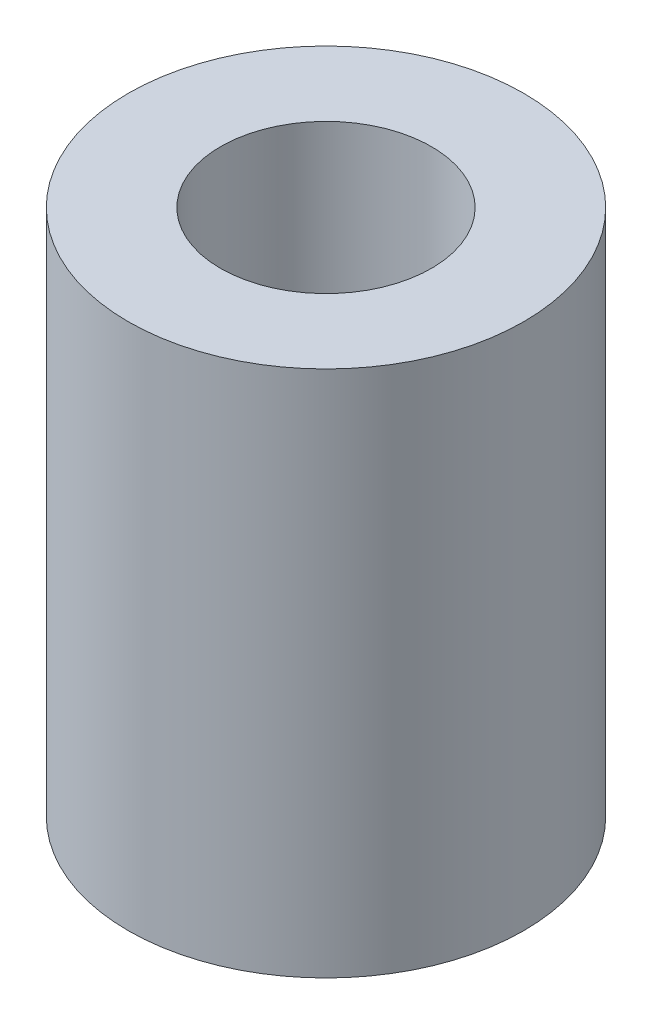
ISO-10303-21;
HEADER;
FILE_DESCRIPTION(('STEP AP214'),'2;1');
FILE_NAME('part.step','',(''),(''),'','','');
FILE_SCHEMA(('AUTOMOTIVE_DESIGN { 1 0 10303 214 1 1 1 1 }'));
ENDSEC;
DATA;
#1=APPLICATION_CONTEXT('core data for automotive mechanical design processes');
#2=APPLICATION_PROTOCOL_DEFINITION('international standard','automotive_design',2000,#1);
#3=PRODUCT_CONTEXT('',#1,'mechanical');
#4=PRODUCT('Part','Part','',(#3));
#5=PRODUCT_RELATED_PRODUCT_CATEGORY('part','',(#4));
#6=PRODUCT_DEFINITION_FORMATION('','',#4);
#7=PRODUCT_DEFINITION_CONTEXT('part definition',#1,'design');
#8=PRODUCT_DEFINITION('design','',#6,#7);
#9=PRODUCT_DEFINITION_SHAPE('','',#8);
#10=(LENGTH_UNIT() NAMED_UNIT(*) SI_UNIT(.MILLI.,.METRE.));
#11=(NAMED_UNIT(*) PLANE_ANGLE_UNIT() SI_UNIT($,.RADIAN.));
#12=(NAMED_UNIT(*) SI_UNIT($,.STERADIAN.) SOLID_ANGLE_UNIT());
#13=UNCERTAINTY_MEASURE_WITH_UNIT(LENGTH_MEASURE(1.E-05),#10,'distance_accuracy_value','');
#14=(GEOMETRIC_REPRESENTATION_CONTEXT(3) GLOBAL_UNCERTAINTY_ASSIGNED_CONTEXT((#13)) GLOBAL_UNIT_ASSIGNED_CONTEXT((#10,
#11,#12)) REPRESENTATION_CONTEXT('',''));
#15=CARTESIAN_POINT('',(0.,0.,0.));
#16=DIRECTION('',(0.,0.,1.));
#17=DIRECTION('',(1.,0.,0.));
#18=AXIS2_PLACEMENT_3D('',#15,#16,#17);
#19=CARTESIAN_POINT('',(0.,8.,0.));
#20=DIRECTION('',(0.,1.,0.));
#21=DIRECTION('',(0.,0.,1.));
#22=AXIS2_PLACEMENT_3D('',#19,#20,#21);
#23=PLANE('',#22);
#24=CARTESIAN_POINT('',(0.,8.,0.));
#25=DIRECTION('',(0.,1.,0.));
#26=DIRECTION('',(0.,0.,1.));
#27=AXIS2_PLACEMENT_3D('',#24,#25,#26);
#28=CIRCLE('',#27,3.);
#29=CARTESIAN_POINT('',(0.,8.,3.));
#30=VERTEX_POINT('',#29);
#31=EDGE_CURVE('E10',#30,#30,#28,.T.);
#32=ORIENTED_EDGE('',*,*,#31,.T.);
#33=EDGE_LOOP('',(#32));
#34=FACE_BOUND('',#33,.T.);
#35=CARTESIAN_POINT('',(0.,8.,0.));
#36=DIRECTION('',(0.,1.,0.));
#37=DIRECTION('',(0.,0.,1.));
#38=AXIS2_PLACEMENT_3D('',#35,#36,#37);
#39=CIRCLE('',#38,1.6);
#40=CARTESIAN_POINT('',(0.,8.,1.6));
#41=VERTEX_POINT('',#40);
#42=EDGE_CURVE('E43',#41,#41,#39,.T.);
#43=ORIENTED_EDGE('',*,*,#42,.F.);
#44=EDGE_LOOP('',(#43));
#45=FACE_BOUND('',#44,.T.);
#46=ADVANCED_FACE('F32',(#34,#45),#23,.T.);
#47=CARTESIAN_POINT('',(0.,0.,0.));
#48=DIRECTION('',(0.,1.,0.));
#49=DIRECTION('',(0.,0.,1.));
#50=AXIS2_PLACEMENT_3D('',#47,#48,#49);
#51=PLANE('',#50);
#52=CARTESIAN_POINT('',(0.,0.,0.));
#53=DIRECTION('',(0.,1.,0.));
#54=DIRECTION('',(0.,0.,1.));
#55=AXIS2_PLACEMENT_3D('',#52,#53,#54);
#56=CIRCLE('',#55,3.);
#57=CARTESIAN_POINT('',(0.,0.,3.));
#58=VERTEX_POINT('',#57);
#59=EDGE_CURVE('E36',#58,#58,#56,.T.);
#60=ORIENTED_EDGE('',*,*,#59,.F.);
#61=EDGE_LOOP('',(#60));
#62=FACE_BOUND('',#61,.T.);
#63=CARTESIAN_POINT('',(0.,0.,0.));
#64=DIRECTION('',(0.,1.,0.));
#65=DIRECTION('',(0.,0.,1.));
#66=AXIS2_PLACEMENT_3D('',#63,#64,#65);
#67=CIRCLE('',#66,1.6);
#68=CARTESIAN_POINT('',(0.,0.,1.6));
#69=VERTEX_POINT('',#68);
#70=EDGE_CURVE('E45',#69,#69,#67,.T.);
#71=ORIENTED_EDGE('',*,*,#70,.T.);
#72=EDGE_LOOP('',(#71));
#73=FACE_BOUND('',#72,.T.);
#74=ADVANCED_FACE('F55',(#62,#73),#51,.F.);
#75=CARTESIAN_POINT('',(0.,8.,0.));
#76=DIRECTION('',(0.,-1.,0.));
#77=DIRECTION('',(0.,0.,-1.));
#78=AXIS2_PLACEMENT_3D('',#75,#76,#77);
#79=CYLINDRICAL_SURFACE('',#78,3.);
#80=ORIENTED_EDGE('',*,*,#31,.F.);
#81=EDGE_LOOP('',(#80));
#82=FACE_BOUND('',#81,.T.);
#83=ORIENTED_EDGE('',*,*,#59,.T.);
#84=EDGE_LOOP('',(#83));
#85=FACE_BOUND('',#84,.T.);
#86=ADVANCED_FACE('F34',(#82,#85),#79,.T.);
#87=CARTESIAN_POINT('',(0.,8.,0.));
#88=DIRECTION('',(0.,-1.,0.));
#89=DIRECTION('',(0.,0.,-1.));
#90=AXIS2_PLACEMENT_3D('',#87,#88,#89);
#91=CYLINDRICAL_SURFACE('',#90,1.6);
#92=ORIENTED_EDGE('',*,*,#42,.T.);
#93=EDGE_LOOP('',(#92));
#94=FACE_BOUND('',#93,.T.);
#95=ORIENTED_EDGE('',*,*,#70,.F.);
#96=EDGE_LOOP('',(#95));
#97=FACE_BOUND('',#96,.T.);
#98=ADVANCED_FACE('F51',(#94,#97),#91,.F.);
#99=CLOSED_SHELL('',(#46,#74,#86,#98));
#100=MANIFOLD_SOLID_BREP('B2',#99);
#101=ADVANCED_BREP_SHAPE_REPRESENTATION('',(#18,#100),#14);
#102=SHAPE_DEFINITION_REPRESENTATION(#9,#101);
ENDSEC;
END-ISO-10303-21;
